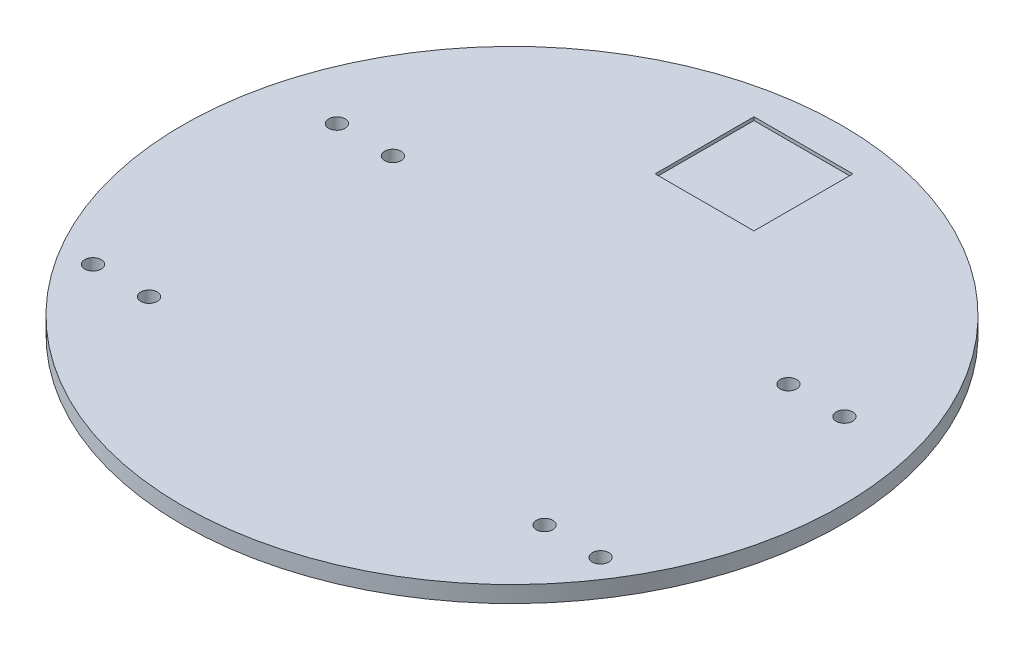
ISO-10303-21;
HEADER;
FILE_DESCRIPTION(('STEP AP214'),'2;1');
FILE_NAME('part.step','',(''),(''),'','','');
FILE_SCHEMA(('AUTOMOTIVE_DESIGN { 1 0 10303 214 1 1 1 1 }'));
ENDSEC;
DATA;
#1=APPLICATION_CONTEXT('core data for automotive mechanical design processes');
#2=APPLICATION_PROTOCOL_DEFINITION('international standard','automotive_design',2000,#1);
#3=PRODUCT_CONTEXT('',#1,'mechanical');
#4=PRODUCT('Part','Part','',(#3));
#5=PRODUCT_RELATED_PRODUCT_CATEGORY('part','',(#4));
#6=PRODUCT_DEFINITION_FORMATION('','',#4);
#7=PRODUCT_DEFINITION_CONTEXT('part definition',#1,'design');
#8=PRODUCT_DEFINITION('design','',#6,#7);
#9=PRODUCT_DEFINITION_SHAPE('','',#8);
#10=(LENGTH_UNIT() NAMED_UNIT(*) SI_UNIT(.MILLI.,.METRE.));
#11=(NAMED_UNIT(*) PLANE_ANGLE_UNIT() SI_UNIT($,.RADIAN.));
#12=(NAMED_UNIT(*) SI_UNIT($,.STERADIAN.) SOLID_ANGLE_UNIT());
#13=UNCERTAINTY_MEASURE_WITH_UNIT(LENGTH_MEASURE(1.E-05),#10,'distance_accuracy_value','');
#14=(GEOMETRIC_REPRESENTATION_CONTEXT(3) GLOBAL_UNCERTAINTY_ASSIGNED_CONTEXT((#13)) GLOBAL_UNIT_ASSIGNED_CONTEXT((#10,
#11,#12)) REPRESENTATION_CONTEXT('',''));
#15=CARTESIAN_POINT('',(0.,0.,0.));
#16=DIRECTION('',(0.,0.,1.));
#17=DIRECTION('',(1.,0.,0.));
#18=AXIS2_PLACEMENT_3D('',#15,#16,#17);
#19=CARTESIAN_POINT('',(0.,5.,0.));
#20=DIRECTION('',(0.,-1.,0.));
#21=DIRECTION('',(0.,0.,-1.));
#22=AXIS2_PLACEMENT_3D('',#19,#20,#21);
#23=CYLINDRICAL_SURFACE('',#22,100.);
#24=CARTESIAN_POINT('',(0.,5.,0.));
#25=DIRECTION('',(0.,1.,0.));
#26=DIRECTION('',(0.,0.,1.));
#27=AXIS2_PLACEMENT_3D('',#24,#25,#26);
#28=CIRCLE('',#27,100.);
#29=CARTESIAN_POINT('',(0.,5.,100.));
#30=VERTEX_POINT('',#29);
#31=EDGE_CURVE('E11',#30,#30,#28,.T.);
#32=ORIENTED_EDGE('',*,*,#31,.F.);
#33=EDGE_LOOP('',(#32));
#34=FACE_BOUND('',#33,.T.);
#35=CARTESIAN_POINT('',(0.,0.,0.));
#36=DIRECTION('',(0.,1.,0.));
#37=DIRECTION('',(0.,0.,1.));
#38=AXIS2_PLACEMENT_3D('',#35,#36,#37);
#39=CIRCLE('',#38,100.);
#40=CARTESIAN_POINT('',(0.,0.,100.));
#41=VERTEX_POINT('',#40);
#42=EDGE_CURVE('E47',#41,#41,#39,.T.);
#43=ORIENTED_EDGE('',*,*,#42,.T.);
#44=EDGE_LOOP('',(#43));
#45=FACE_BOUND('',#44,.T.);
#46=ADVANCED_FACE('F38',(#34,#45),#23,.T.);
#47=CARTESIAN_POINT('',(0.,5.,0.));
#48=DIRECTION('',(0.,1.,0.));
#49=DIRECTION('',(0.,0.,1.));
#50=AXIS2_PLACEMENT_3D('',#47,#48,#49);
#51=PLANE('',#50);
#52=DIRECTION('',(0.,0.,1.));
#53=VECTOR('',#52,1.);
#54=CARTESIAN_POINT('',(-15.5082804152075,5.,-58.9360512571358));
#55=LINE('',#54,#53);
#56=CARTESIAN_POINT('',(-15.5082804152075,5.,-88.9360512571358));
#57=VERTEX_POINT('',#56);
#58=CARTESIAN_POINT('',(-15.5082804152075,5.,-58.9360512571358));
#59=VERTEX_POINT('',#58);
#60=EDGE_CURVE('E55',#57,#59,#55,.T.);
#61=ORIENTED_EDGE('',*,*,#60,.F.);
#62=DIRECTION('',(-1.,0.,0.));
#63=VECTOR('',#62,1.);
#64=CARTESIAN_POINT('',(-15.5082804152075,5.,-88.9360512571358));
#65=LINE('',#64,#63);
#66=CARTESIAN_POINT('',(14.4917195847925,5.,-88.9360512571358));
#67=VERTEX_POINT('',#66);
#68=EDGE_CURVE('E110',#67,#57,#65,.T.);
#69=ORIENTED_EDGE('',*,*,#68,.F.);
#70=DIRECTION('',(0.,0.,-1.));
#71=VECTOR('',#70,1.);
#72=CARTESIAN_POINT('',(14.4917195847925,5.,-58.9360512571358));
#73=LINE('',#72,#71);
#74=CARTESIAN_POINT('',(14.4917195847925,5.,-58.9360512571358));
#75=VERTEX_POINT('',#74);
#76=EDGE_CURVE('E119',#75,#67,#73,.T.);
#77=ORIENTED_EDGE('',*,*,#76,.F.);
#78=DIRECTION('',(1.,0.,0.));
#79=VECTOR('',#78,1.);
#80=CARTESIAN_POINT('',(-15.5082804152075,5.,-58.9360512571358));
#81=LINE('',#80,#79);
#82=EDGE_CURVE('E90',#59,#75,#81,.T.);
#83=ORIENTED_EDGE('',*,*,#82,.F.);
#84=EDGE_LOOP('',(#61,#69,#77,#83));
#85=FACE_BOUND('',#84,.T.);
#86=CARTESIAN_POINT('',(60.,5.,-23.8717035887572));
#87=DIRECTION('',(0.,1.,0.));
#88=DIRECTION('',(0.,0.,-1.));
#89=AXIS2_PLACEMENT_3D('',#86,#87,#88);
#90=CIRCLE('',#89,2.5);
#91=CARTESIAN_POINT('',(60.,5.,-26.3717035887572));
#92=VERTEX_POINT('',#91);
#93=EDGE_CURVE('E139',#92,#92,#90,.T.);
#94=ORIENTED_EDGE('',*,*,#93,.F.);
#95=EDGE_LOOP('',(#94));
#96=FACE_BOUND('',#95,.T.);
#97=CARTESIAN_POINT('',(-60.,5.,-23.8717035887572));
#98=DIRECTION('',(0.,1.,0.));
#99=DIRECTION('',(0.,0.,1.));
#100=AXIS2_PLACEMENT_3D('',#97,#98,#99);
#101=CIRCLE('',#100,2.5);
#102=CARTESIAN_POINT('',(-60.,5.,-21.3717035887572));
#103=VERTEX_POINT('',#102);
#104=EDGE_CURVE('E143',#103,#103,#101,.T.);
#105=ORIENTED_EDGE('',*,*,#104,.F.);
#106=EDGE_LOOP('',(#105));
#107=FACE_BOUND('',#106,.T.);
#108=CARTESIAN_POINT('',(-60.,5.,50.1282964112428));
#109=DIRECTION('',(0.,1.,0.));
#110=DIRECTION('',(0.,0.,1.));
#111=AXIS2_PLACEMENT_3D('',#108,#109,#110);
#112=CIRCLE('',#111,2.5);
#113=CARTESIAN_POINT('',(-60.,5.,52.6282964112428));
#114=VERTEX_POINT('',#113);
#115=EDGE_CURVE('E147',#114,#114,#112,.T.);
#116=ORIENTED_EDGE('',*,*,#115,.F.);
#117=EDGE_LOOP('',(#116));
#118=FACE_BOUND('',#117,.T.);
#119=CARTESIAN_POINT('',(-77.,5.,-23.8717035887572));
#120=DIRECTION('',(0.,1.,0.));
#121=DIRECTION('',(0.,0.,1.));
#122=AXIS2_PLACEMENT_3D('',#119,#120,#121);
#123=CIRCLE('',#122,2.5);
#124=CARTESIAN_POINT('',(-77.,5.,-21.3717035887572));
#125=VERTEX_POINT('',#124);
#126=EDGE_CURVE('E151',#125,#125,#123,.T.);
#127=ORIENTED_EDGE('',*,*,#126,.F.);
#128=EDGE_LOOP('',(#127));
#129=FACE_BOUND('',#128,.T.);
#130=CARTESIAN_POINT('',(77.,5.,50.1282964112428));
#131=DIRECTION('',(0.,1.,0.));
#132=DIRECTION('',(0.,0.,-1.));
#133=AXIS2_PLACEMENT_3D('',#130,#131,#132);
#134=CIRCLE('',#133,2.5);
#135=CARTESIAN_POINT('',(77.,5.,47.6282964112428));
#136=VERTEX_POINT('',#135);
#137=EDGE_CURVE('E126',#136,#136,#134,.T.);
#138=ORIENTED_EDGE('',*,*,#137,.F.);
#139=EDGE_LOOP('',(#138));
#140=FACE_BOUND('',#139,.T.);
#141=CARTESIAN_POINT('',(77.,5.,-23.8717035887572));
#142=DIRECTION('',(0.,1.,0.));
#143=DIRECTION('',(0.,0.,-1.));
#144=AXIS2_PLACEMENT_3D('',#141,#142,#143);
#145=CIRCLE('',#144,2.5);
#146=CARTESIAN_POINT('',(77.,5.,-26.3717035887572));
#147=VERTEX_POINT('',#146);
#148=EDGE_CURVE('E134',#147,#147,#145,.T.);
#149=ORIENTED_EDGE('',*,*,#148,.F.);
#150=EDGE_LOOP('',(#149));
#151=FACE_BOUND('',#150,.T.);
#152=CARTESIAN_POINT('',(60.,5.,50.1282964112428));
#153=DIRECTION('',(0.,1.,0.));
#154=DIRECTION('',(0.,0.,-1.));
#155=AXIS2_PLACEMENT_3D('',#152,#153,#154);
#156=CIRCLE('',#155,2.5);
#157=CARTESIAN_POINT('',(60.,5.,47.6282964112428));
#158=VERTEX_POINT('',#157);
#159=EDGE_CURVE('E135',#158,#158,#156,.T.);
#160=ORIENTED_EDGE('',*,*,#159,.F.);
#161=EDGE_LOOP('',(#160));
#162=FACE_BOUND('',#161,.T.);
#163=CARTESIAN_POINT('',(-77.,5.,50.1282964112428));
#164=DIRECTION('',(0.,1.,0.));
#165=DIRECTION('',(0.,0.,1.));
#166=AXIS2_PLACEMENT_3D('',#163,#164,#165);
#167=CIRCLE('',#166,2.5);
#168=CARTESIAN_POINT('',(-77.,5.,52.6282964112428));
#169=VERTEX_POINT('',#168);
#170=EDGE_CURVE('E155',#169,#169,#167,.T.);
#171=ORIENTED_EDGE('',*,*,#170,.F.);
#172=EDGE_LOOP('',(#171));
#173=FACE_BOUND('',#172,.T.);
#174=ORIENTED_EDGE('',*,*,#31,.T.);
#175=EDGE_LOOP('',(#174));
#176=FACE_BOUND('',#175,.T.);
#177=ADVANCED_FACE('F216',(#85,#96,#107,#118,#129,#140,#151,#162,#173,#176),#51,.T.);
#178=CARTESIAN_POINT('',(0.,0.,0.));
#179=DIRECTION('',(0.,1.,0.));
#180=DIRECTION('',(0.,0.,1.));
#181=AXIS2_PLACEMENT_3D('',#178,#179,#180);
#182=PLANE('',#181);
#183=CARTESIAN_POINT('',(60.,0.,-23.8717035887572));
#184=DIRECTION('',(0.,1.,0.));
#185=DIRECTION('',(0.,0.,1.));
#186=AXIS2_PLACEMENT_3D('',#183,#184,#185);
#187=CIRCLE('',#186,2.5);
#188=CARTESIAN_POINT('',(60.,0.,-21.3717035887572));
#189=VERTEX_POINT('',#188);
#190=EDGE_CURVE('E41',#189,#189,#187,.T.);
#191=ORIENTED_EDGE('',*,*,#190,.T.);
#192=EDGE_LOOP('',(#191));
#193=FACE_BOUND('',#192,.T.);
#194=CARTESIAN_POINT('',(-60.,0.,-23.8717035887572));
#195=DIRECTION('',(0.,1.,0.));
#196=DIRECTION('',(0.,0.,1.));
#197=AXIS2_PLACEMENT_3D('',#194,#195,#196);
#198=CIRCLE('',#197,2.5);
#199=CARTESIAN_POINT('',(-60.,0.,-21.3717035887572));
#200=VERTEX_POINT('',#199);
#201=EDGE_CURVE('E188',#200,#200,#198,.T.);
#202=ORIENTED_EDGE('',*,*,#201,.T.);
#203=EDGE_LOOP('',(#202));
#204=FACE_BOUND('',#203,.T.);
#205=CARTESIAN_POINT('',(-60.,0.,50.1282964112428));
#206=DIRECTION('',(0.,1.,0.));
#207=DIRECTION('',(0.,0.,1.));
#208=AXIS2_PLACEMENT_3D('',#205,#206,#207);
#209=CIRCLE('',#208,2.5);
#210=CARTESIAN_POINT('',(-60.,0.,52.6282964112428));
#211=VERTEX_POINT('',#210);
#212=EDGE_CURVE('E185',#211,#211,#209,.T.);
#213=ORIENTED_EDGE('',*,*,#212,.T.);
#214=EDGE_LOOP('',(#213));
#215=FACE_BOUND('',#214,.T.);
#216=CARTESIAN_POINT('',(-77.,0.,-23.8717035887572));
#217=DIRECTION('',(0.,1.,0.));
#218=DIRECTION('',(0.,0.,1.));
#219=AXIS2_PLACEMENT_3D('',#216,#217,#218);
#220=CIRCLE('',#219,2.5);
#221=CARTESIAN_POINT('',(-77.,0.,-21.3717035887572));
#222=VERTEX_POINT('',#221);
#223=EDGE_CURVE('E181',#222,#222,#220,.T.);
#224=ORIENTED_EDGE('',*,*,#223,.T.);
#225=EDGE_LOOP('',(#224));
#226=FACE_BOUND('',#225,.T.);
#227=CARTESIAN_POINT('',(77.,0.,50.1282964112428));
#228=DIRECTION('',(0.,1.,0.));
#229=DIRECTION('',(0.,0.,1.));
#230=AXIS2_PLACEMENT_3D('',#227,#228,#229);
#231=CIRCLE('',#230,2.5);
#232=CARTESIAN_POINT('',(77.,0.,52.6282964112428));
#233=VERTEX_POINT('',#232);
#234=EDGE_CURVE('E177',#233,#233,#231,.T.);
#235=ORIENTED_EDGE('',*,*,#234,.T.);
#236=EDGE_LOOP('',(#235));
#237=FACE_BOUND('',#236,.T.);
#238=CARTESIAN_POINT('',(77.,0.,-23.8717035887572));
#239=DIRECTION('',(0.,1.,0.));
#240=DIRECTION('',(0.,0.,1.));
#241=AXIS2_PLACEMENT_3D('',#238,#239,#240);
#242=CIRCLE('',#241,2.5);
#243=CARTESIAN_POINT('',(77.,0.,-21.3717035887572));
#244=VERTEX_POINT('',#243);
#245=EDGE_CURVE('E173',#244,#244,#242,.T.);
#246=ORIENTED_EDGE('',*,*,#245,.T.);
#247=EDGE_LOOP('',(#246));
#248=FACE_BOUND('',#247,.T.);
#249=CARTESIAN_POINT('',(60.,0.,50.1282964112428));
#250=DIRECTION('',(0.,1.,0.));
#251=DIRECTION('',(0.,0.,1.));
#252=AXIS2_PLACEMENT_3D('',#249,#250,#251);
#253=CIRCLE('',#252,2.5);
#254=CARTESIAN_POINT('',(60.,0.,52.6282964112428));
#255=VERTEX_POINT('',#254);
#256=EDGE_CURVE('E169',#255,#255,#253,.T.);
#257=ORIENTED_EDGE('',*,*,#256,.T.);
#258=EDGE_LOOP('',(#257));
#259=FACE_BOUND('',#258,.T.);
#260=CARTESIAN_POINT('',(-77.,0.,50.1282964112428));
#261=DIRECTION('',(0.,1.,0.));
#262=DIRECTION('',(0.,0.,1.));
#263=AXIS2_PLACEMENT_3D('',#260,#261,#262);
#264=CIRCLE('',#263,2.5);
#265=CARTESIAN_POINT('',(-77.,0.,52.6282964112428));
#266=VERTEX_POINT('',#265);
#267=EDGE_CURVE('E161',#266,#266,#264,.T.);
#268=ORIENTED_EDGE('',*,*,#267,.T.);
#269=EDGE_LOOP('',(#268));
#270=FACE_BOUND('',#269,.T.);
#271=ORIENTED_EDGE('',*,*,#42,.F.);
#272=EDGE_LOOP('',(#271));
#273=FACE_BOUND('',#272,.T.);
#274=ADVANCED_FACE('F197',(#193,#204,#215,#226,#237,#248,#259,#270,#273),#182,.F.);
#275=CARTESIAN_POINT('',(-77.,-5.,50.1282964112428));
#276=DIRECTION('',(0.,1.,0.));
#277=DIRECTION('',(0.,0.,1.));
#278=AXIS2_PLACEMENT_3D('',#275,#276,#277);
#279=CYLINDRICAL_SURFACE('',#278,2.5);
#280=ORIENTED_EDGE('',*,*,#170,.T.);
#281=EDGE_LOOP('',(#280));
#282=FACE_BOUND('',#281,.T.);
#283=ORIENTED_EDGE('',*,*,#267,.F.);
#284=EDGE_LOOP('',(#283));
#285=FACE_BOUND('',#284,.T.);
#286=ADVANCED_FACE('F229',(#282,#285),#279,.F.);
#287=CARTESIAN_POINT('',(60.,-5.,50.1282964112428));
#288=DIRECTION('',(0.,1.,0.));
#289=DIRECTION('',(0.,0.,1.));
#290=AXIS2_PLACEMENT_3D('',#287,#288,#289);
#291=CYLINDRICAL_SURFACE('',#290,2.5);
#292=ORIENTED_EDGE('',*,*,#159,.T.);
#293=EDGE_LOOP('',(#292));
#294=FACE_BOUND('',#293,.T.);
#295=ORIENTED_EDGE('',*,*,#256,.F.);
#296=EDGE_LOOP('',(#295));
#297=FACE_BOUND('',#296,.T.);
#298=ADVANCED_FACE('F234',(#294,#297),#291,.F.);
#299=CARTESIAN_POINT('',(77.,-5.,-23.8717035887572));
#300=DIRECTION('',(0.,1.,0.));
#301=DIRECTION('',(0.,0.,1.));
#302=AXIS2_PLACEMENT_3D('',#299,#300,#301);
#303=CYLINDRICAL_SURFACE('',#302,2.5);
#304=ORIENTED_EDGE('',*,*,#148,.T.);
#305=EDGE_LOOP('',(#304));
#306=FACE_BOUND('',#305,.T.);
#307=ORIENTED_EDGE('',*,*,#245,.F.);
#308=EDGE_LOOP('',(#307));
#309=FACE_BOUND('',#308,.T.);
#310=ADVANCED_FACE('F247',(#306,#309),#303,.F.);
#311=CARTESIAN_POINT('',(77.,-5.,50.1282964112428));
#312=DIRECTION('',(0.,1.,0.));
#313=DIRECTION('',(0.,0.,1.));
#314=AXIS2_PLACEMENT_3D('',#311,#312,#313);
#315=CYLINDRICAL_SURFACE('',#314,2.5);
#316=ORIENTED_EDGE('',*,*,#137,.T.);
#317=EDGE_LOOP('',(#316));
#318=FACE_BOUND('',#317,.T.);
#319=ORIENTED_EDGE('',*,*,#234,.F.);
#320=EDGE_LOOP('',(#319));
#321=FACE_BOUND('',#320,.T.);
#322=ADVANCED_FACE('F242',(#318,#321),#315,.F.);
#323=CARTESIAN_POINT('',(-77.,-5.,-23.8717035887572));
#324=DIRECTION('',(0.,1.,0.));
#325=DIRECTION('',(0.,0.,1.));
#326=AXIS2_PLACEMENT_3D('',#323,#324,#325);
#327=CYLINDRICAL_SURFACE('',#326,2.5);
#328=ORIENTED_EDGE('',*,*,#126,.T.);
#329=EDGE_LOOP('',(#328));
#330=FACE_BOUND('',#329,.T.);
#331=ORIENTED_EDGE('',*,*,#223,.F.);
#332=EDGE_LOOP('',(#331));
#333=FACE_BOUND('',#332,.T.);
#334=ADVANCED_FACE('F239',(#330,#333),#327,.F.);
#335=CARTESIAN_POINT('',(-60.,-5.,50.1282964112428));
#336=DIRECTION('',(0.,1.,0.));
#337=DIRECTION('',(0.,0.,1.));
#338=AXIS2_PLACEMENT_3D('',#335,#336,#337);
#339=CYLINDRICAL_SURFACE('',#338,2.5);
#340=ORIENTED_EDGE('',*,*,#115,.T.);
#341=EDGE_LOOP('',(#340));
#342=FACE_BOUND('',#341,.T.);
#343=ORIENTED_EDGE('',*,*,#212,.F.);
#344=EDGE_LOOP('',(#343));
#345=FACE_BOUND('',#344,.T.);
#346=ADVANCED_FACE('F211',(#342,#345),#339,.F.);
#347=CARTESIAN_POINT('',(-60.,-5.,-23.8717035887572));
#348=DIRECTION('',(0.,1.,0.));
#349=DIRECTION('',(0.,0.,1.));
#350=AXIS2_PLACEMENT_3D('',#347,#348,#349);
#351=CYLINDRICAL_SURFACE('',#350,2.5);
#352=ORIENTED_EDGE('',*,*,#104,.T.);
#353=EDGE_LOOP('',(#352));
#354=FACE_BOUND('',#353,.T.);
#355=ORIENTED_EDGE('',*,*,#201,.F.);
#356=EDGE_LOOP('',(#355));
#357=FACE_BOUND('',#356,.T.);
#358=ADVANCED_FACE('F202',(#354,#357),#351,.F.);
#359=CARTESIAN_POINT('',(60.,-5.,-23.8717035887572));
#360=DIRECTION('',(0.,1.,0.));
#361=DIRECTION('',(0.,0.,1.));
#362=AXIS2_PLACEMENT_3D('',#359,#360,#361);
#363=CYLINDRICAL_SURFACE('',#362,2.5);
#364=ORIENTED_EDGE('',*,*,#93,.T.);
#365=EDGE_LOOP('',(#364));
#366=FACE_BOUND('',#365,.T.);
#367=ORIENTED_EDGE('',*,*,#190,.F.);
#368=EDGE_LOOP('',(#367));
#369=FACE_BOUND('',#368,.T.);
#370=ADVANCED_FACE('F199',(#366,#369),#363,.F.);
#371=CARTESIAN_POINT('',(-15.5082804152075,4.,-58.9360512571358));
#372=DIRECTION('',(-1.,0.,0.));
#373=DIRECTION('',(0.,0.,1.));
#374=AXIS2_PLACEMENT_3D('',#371,#372,#373);
#375=PLANE('',#374);
#376=ORIENTED_EDGE('',*,*,#60,.T.);
#377=DIRECTION('',(0.,1.,0.));
#378=VECTOR('',#377,1.);
#379=CARTESIAN_POINT('',(-15.5082804152075,4.,-58.9360512571358));
#380=LINE('',#379,#378);
#381=CARTESIAN_POINT('',(-15.5082804152075,4.,-58.9360512571358));
#382=VERTEX_POINT('',#381);
#383=EDGE_CURVE('E78',#382,#59,#380,.T.);
#384=ORIENTED_EDGE('',*,*,#383,.F.);
#385=DIRECTION('',(0.,0.,1.));
#386=VECTOR('',#385,1.);
#387=CARTESIAN_POINT('',(-15.5082804152075,4.,-58.9360512571358));
#388=LINE('',#387,#386);
#389=CARTESIAN_POINT('',(-15.5082804152075,4.,-88.9360512571358));
#390=VERTEX_POINT('',#389);
#391=EDGE_CURVE('E106',#390,#382,#388,.T.);
#392=ORIENTED_EDGE('',*,*,#391,.F.);
#393=DIRECTION('',(0.,1.,0.));
#394=VECTOR('',#393,1.);
#395=CARTESIAN_POINT('',(-15.5082804152075,4.,-88.9360512571358));
#396=LINE('',#395,#394);
#397=EDGE_CURVE('E63',#390,#57,#396,.T.);
#398=ORIENTED_EDGE('',*,*,#397,.T.);
#399=EDGE_LOOP('',(#376,#384,#392,#398));
#400=FACE_BOUND('',#399,.T.);
#401=ADVANCED_FACE('F201',(#400),#375,.F.);
#402=CARTESIAN_POINT('',(-15.5082804152075,4.,-88.9360512571358));
#403=DIRECTION('',(0.,0.,-1.));
#404=DIRECTION('',(-1.,0.,0.));
#405=AXIS2_PLACEMENT_3D('',#402,#403,#404);
#406=PLANE('',#405);
#407=ORIENTED_EDGE('',*,*,#68,.T.);
#408=ORIENTED_EDGE('',*,*,#397,.F.);
#409=DIRECTION('',(-1.,0.,0.));
#410=VECTOR('',#409,1.);
#411=CARTESIAN_POINT('',(-15.5082804152075,4.,-88.9360512571358));
#412=LINE('',#411,#410);
#413=CARTESIAN_POINT('',(14.4917195847925,4.,-88.9360512571358));
#414=VERTEX_POINT('',#413);
#415=EDGE_CURVE('E103',#414,#390,#412,.T.);
#416=ORIENTED_EDGE('',*,*,#415,.F.);
#417=DIRECTION('',(0.,1.,0.));
#418=VECTOR('',#417,1.);
#419=CARTESIAN_POINT('',(14.4917195847925,4.,-88.9360512571358));
#420=LINE('',#419,#418);
#421=EDGE_CURVE('E95',#414,#67,#420,.T.);
#422=ORIENTED_EDGE('',*,*,#421,.T.);
#423=EDGE_LOOP('',(#407,#408,#416,#422));
#424=FACE_BOUND('',#423,.T.);
#425=ADVANCED_FACE('F209',(#424),#406,.F.);
#426=CARTESIAN_POINT('',(14.4917195847925,4.,-58.9360512571358));
#427=DIRECTION('',(1.,0.,0.));
#428=DIRECTION('',(0.,0.,-1.));
#429=AXIS2_PLACEMENT_3D('',#426,#427,#428);
#430=PLANE('',#429);
#431=ORIENTED_EDGE('',*,*,#76,.T.);
#432=ORIENTED_EDGE('',*,*,#421,.F.);
#433=DIRECTION('',(0.,0.,-1.));
#434=VECTOR('',#433,1.);
#435=CARTESIAN_POINT('',(14.4917195847925,4.,-58.9360512571358));
#436=LINE('',#435,#434);
#437=CARTESIAN_POINT('',(14.4917195847925,4.,-58.9360512571358));
#438=VERTEX_POINT('',#437);
#439=EDGE_CURVE('E98',#438,#414,#436,.T.);
#440=ORIENTED_EDGE('',*,*,#439,.F.);
#441=DIRECTION('',(0.,1.,0.));
#442=VECTOR('',#441,1.);
#443=CARTESIAN_POINT('',(14.4917195847925,4.,-58.9360512571358));
#444=LINE('',#443,#442);
#445=EDGE_CURVE('E83',#438,#75,#444,.T.);
#446=ORIENTED_EDGE('',*,*,#445,.T.);
#447=EDGE_LOOP('',(#431,#432,#440,#446));
#448=FACE_BOUND('',#447,.T.);
#449=ADVANCED_FACE('F99',(#448),#430,.F.);
#450=CARTESIAN_POINT('',(-15.5082804152075,4.,-58.9360512571358));
#451=DIRECTION('',(0.,0.,1.));
#452=DIRECTION('',(1.,0.,0.));
#453=AXIS2_PLACEMENT_3D('',#450,#451,#452);
#454=PLANE('',#453);
#455=ORIENTED_EDGE('',*,*,#82,.T.);
#456=ORIENTED_EDGE('',*,*,#445,.F.);
#457=DIRECTION('',(1.,0.,0.));
#458=VECTOR('',#457,1.);
#459=CARTESIAN_POINT('',(-15.5082804152075,4.,-58.9360512571358));
#460=LINE('',#459,#458);
#461=EDGE_CURVE('E87',#382,#438,#460,.T.);
#462=ORIENTED_EDGE('',*,*,#461,.F.);
#463=ORIENTED_EDGE('',*,*,#383,.T.);
#464=EDGE_LOOP('',(#455,#456,#462,#463));
#465=FACE_BOUND('',#464,.T.);
#466=ADVANCED_FACE('F85',(#465),#454,.F.);
#467=CARTESIAN_POINT('',(0.,4.,0.));
#468=DIRECTION('',(0.,-1.,0.));
#469=DIRECTION('',(0.,0.,-1.));
#470=AXIS2_PLACEMENT_3D('',#467,#468,#469);
#471=PLANE('',#470);
#472=ORIENTED_EDGE('',*,*,#391,.T.);
#473=ORIENTED_EDGE('',*,*,#461,.T.);
#474=ORIENTED_EDGE('',*,*,#439,.T.);
#475=ORIENTED_EDGE('',*,*,#415,.T.);
#476=EDGE_LOOP('',(#472,#473,#474,#475));
#477=FACE_BOUND('',#476,.T.);
#478=ADVANCED_FACE('F105',(#477),#471,.F.);
#479=CLOSED_SHELL('',(#46,#177,#274,#286,#298,#310,#322,#334,#346,#358,#370,#401,#425,#449,#466,#478));
#480=MANIFOLD_SOLID_BREP('B2',#479);
#481=ADVANCED_BREP_SHAPE_REPRESENTATION('',(#18,#480),#14);
#482=SHAPE_DEFINITION_REPRESENTATION(#9,#481);
ENDSEC;
END-ISO-10303-21;
